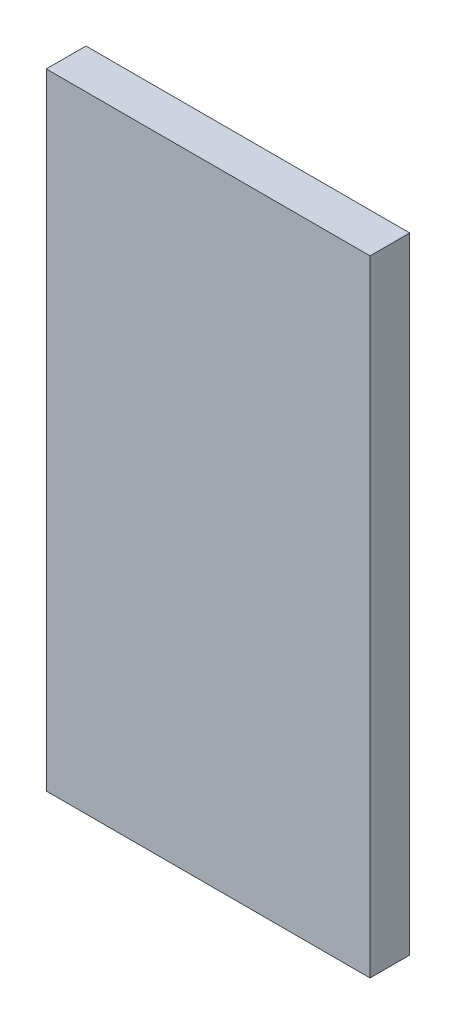
ISO-10303-21;
HEADER;
FILE_DESCRIPTION(('STEP AP214'),'2;1');
FILE_NAME('part.step','',(''),(''),'','','');
FILE_SCHEMA(('AUTOMOTIVE_DESIGN { 1 0 10303 214 1 1 1 1 }'));
ENDSEC;
DATA;
#1=APPLICATION_CONTEXT('core data for automotive mechanical design processes');
#2=APPLICATION_PROTOCOL_DEFINITION('international standard','automotive_design',2000,#1);
#3=PRODUCT_CONTEXT('',#1,'mechanical');
#4=PRODUCT('Part','Part','',(#3));
#5=PRODUCT_RELATED_PRODUCT_CATEGORY('part','',(#4));
#6=PRODUCT_DEFINITION_FORMATION('','',#4);
#7=PRODUCT_DEFINITION_CONTEXT('part definition',#1,'design');
#8=PRODUCT_DEFINITION('design','',#6,#7);
#9=PRODUCT_DEFINITION_SHAPE('','',#8);
#10=(LENGTH_UNIT() NAMED_UNIT(*) SI_UNIT(.MILLI.,.METRE.));
#11=(NAMED_UNIT(*) PLANE_ANGLE_UNIT() SI_UNIT($,.RADIAN.));
#12=(NAMED_UNIT(*) SI_UNIT($,.STERADIAN.) SOLID_ANGLE_UNIT());
#13=UNCERTAINTY_MEASURE_WITH_UNIT(LENGTH_MEASURE(1.E-05),#10,'distance_accuracy_value','');
#14=(GEOMETRIC_REPRESENTATION_CONTEXT(3) GLOBAL_UNCERTAINTY_ASSIGNED_CONTEXT((#13)) GLOBAL_UNIT_ASSIGNED_CONTEXT((#10,
#11,#12)) REPRESENTATION_CONTEXT('',''));
#15=CARTESIAN_POINT('',(0.,0.,0.));
#16=DIRECTION('',(0.,0.,1.));
#17=DIRECTION('',(1.,0.,0.));
#18=AXIS2_PLACEMENT_3D('',#15,#16,#17);
#19=CARTESIAN_POINT('',(-2.948,2.122,0.1));
#20=DIRECTION('',(0.,0.,1.));
#21=DIRECTION('',(1.,0.,0.));
#22=AXIS2_PLACEMENT_3D('',#19,#20,#21);
#23=PLANE('',#22);
#24=DIRECTION('',(0.,1.,0.));
#25=VECTOR('',#24,1.);
#26=CARTESIAN_POINT('',(-2.132,2.122,0.1));
#27=LINE('',#26,#25);
#28=CARTESIAN_POINT('',(-2.132,3.698,0.1));
#29=VERTEX_POINT('',#28);
#30=CARTESIAN_POINT('',(-2.132,2.122,0.1));
#31=VERTEX_POINT('',#30);
#32=EDGE_CURVE('E75',#29,#31,#27,.F.);
#33=ORIENTED_EDGE('',*,*,#32,.F.);
#34=DIRECTION('',(1.,0.,0.));
#35=VECTOR('',#34,1.);
#36=CARTESIAN_POINT('',(-2.948,3.698,0.1));
#37=LINE('',#36,#35);
#38=CARTESIAN_POINT('',(-2.948,3.698,0.1));
#39=VERTEX_POINT('',#38);
#40=EDGE_CURVE('E57',#39,#29,#37,.T.);
#41=ORIENTED_EDGE('',*,*,#40,.F.);
#42=DIRECTION('',(0.,1.,0.));
#43=VECTOR('',#42,1.);
#44=CARTESIAN_POINT('',(-2.948,2.122,0.1));
#45=LINE('',#44,#43);
#46=CARTESIAN_POINT('',(-2.948,2.122,0.1));
#47=VERTEX_POINT('',#46);
#48=EDGE_CURVE('E19',#39,#47,#45,.F.);
#49=ORIENTED_EDGE('',*,*,#48,.T.);
#50=DIRECTION('',(1.,0.,0.));
#51=VECTOR('',#50,1.);
#52=CARTESIAN_POINT('',(-2.948,2.122,0.1));
#53=LINE('',#52,#51);
#54=EDGE_CURVE('E54',#47,#31,#53,.T.);
#55=ORIENTED_EDGE('',*,*,#54,.T.);
#56=EDGE_LOOP('',(#33,#41,#49,#55));
#57=FACE_BOUND('',#56,.T.);
#58=ADVANCED_FACE('F16',(#57),#23,.T.);
#59=CARTESIAN_POINT('',(-2.948,2.122,0.));
#60=DIRECTION('',(1.,0.,0.));
#61=DIRECTION('',(0.,0.,-1.));
#62=AXIS2_PLACEMENT_3D('',#59,#60,#61);
#63=PLANE('',#62);
#64=DIRECTION('',(0.,0.,1.));
#65=VECTOR('',#64,1.);
#66=CARTESIAN_POINT('',(-2.948,3.698,0.));
#67=LINE('',#66,#65);
#68=CARTESIAN_POINT('',(-2.948,3.698,0.));
#69=VERTEX_POINT('',#68);
#70=EDGE_CURVE('E77',#69,#39,#67,.T.);
#71=ORIENTED_EDGE('',*,*,#70,.F.);
#72=DIRECTION('',(0.,1.,0.));
#73=VECTOR('',#72,1.);
#74=CARTESIAN_POINT('',(-2.948,2.122,0.));
#75=LINE('',#74,#73);
#76=CARTESIAN_POINT('',(-2.948,2.122,0.));
#77=VERTEX_POINT('',#76);
#78=EDGE_CURVE('E72',#69,#77,#75,.F.);
#79=ORIENTED_EDGE('',*,*,#78,.T.);
#80=DIRECTION('',(0.,0.,1.));
#81=VECTOR('',#80,1.);
#82=CARTESIAN_POINT('',(-2.948,2.122,0.));
#83=LINE('',#82,#81);
#84=EDGE_CURVE('E62',#77,#47,#83,.T.);
#85=ORIENTED_EDGE('',*,*,#84,.T.);
#86=ORIENTED_EDGE('',*,*,#48,.F.);
#87=EDGE_LOOP('',(#71,#79,#85,#86));
#88=FACE_BOUND('',#87,.T.);
#89=ADVANCED_FACE('F71',(#88),#63,.F.);
#90=CARTESIAN_POINT('',(-2.948,2.122,0.));
#91=DIRECTION('',(0.,1.,0.));
#92=DIRECTION('',(0.,0.,1.));
#93=AXIS2_PLACEMENT_3D('',#90,#91,#92);
#94=PLANE('',#93);
#95=ORIENTED_EDGE('',*,*,#54,.F.);
#96=ORIENTED_EDGE('',*,*,#84,.F.);
#97=DIRECTION('',(1.,0.,0.));
#98=VECTOR('',#97,1.);
#99=CARTESIAN_POINT('',(-2.948,2.122,0.));
#100=LINE('',#99,#98);
#101=CARTESIAN_POINT('',(-2.132,2.122,0.));
#102=VERTEX_POINT('',#101);
#103=EDGE_CURVE('E82',#77,#102,#100,.T.);
#104=ORIENTED_EDGE('',*,*,#103,.T.);
#105=DIRECTION('',(0.,0.,-1.));
#106=VECTOR('',#105,1.);
#107=CARTESIAN_POINT('',(-2.132,2.122,0.));
#108=LINE('',#107,#106);
#109=EDGE_CURVE('E68',#31,#102,#108,.T.);
#110=ORIENTED_EDGE('',*,*,#109,.F.);
#111=EDGE_LOOP('',(#95,#96,#104,#110));
#112=FACE_BOUND('',#111,.T.);
#113=ADVANCED_FACE('F65',(#112),#94,.F.);
#114=CARTESIAN_POINT('',(-2.132,2.122,0.));
#115=DIRECTION('',(1.,0.,0.));
#116=DIRECTION('',(0.,0.,-1.));
#117=AXIS2_PLACEMENT_3D('',#114,#115,#116);
#118=PLANE('',#117);
#119=DIRECTION('',(0.,0.,1.));
#120=VECTOR('',#119,1.);
#121=CARTESIAN_POINT('',(-2.132,3.698,0.));
#122=LINE('',#121,#120);
#123=CARTESIAN_POINT('',(-2.132,3.698,0.));
#124=VERTEX_POINT('',#123);
#125=EDGE_CURVE('E33',#29,#124,#122,.F.);
#126=ORIENTED_EDGE('',*,*,#125,.F.);
#127=ORIENTED_EDGE('',*,*,#32,.T.);
#128=ORIENTED_EDGE('',*,*,#109,.T.);
#129=DIRECTION('',(0.,1.,0.));
#130=VECTOR('',#129,1.);
#131=CARTESIAN_POINT('',(-2.132,2.122,0.));
#132=LINE('',#131,#130);
#133=EDGE_CURVE('E25',#102,#124,#132,.T.);
#134=ORIENTED_EDGE('',*,*,#133,.T.);
#135=EDGE_LOOP('',(#126,#127,#128,#134));
#136=FACE_BOUND('',#135,.T.);
#137=ADVANCED_FACE('F87',(#136),#118,.T.);
#138=CARTESIAN_POINT('',(-2.948,3.698,0.));
#139=DIRECTION('',(0.,1.,0.));
#140=DIRECTION('',(0.,0.,1.));
#141=AXIS2_PLACEMENT_3D('',#138,#139,#140);
#142=PLANE('',#141);
#143=ORIENTED_EDGE('',*,*,#40,.T.);
#144=ORIENTED_EDGE('',*,*,#125,.T.);
#145=DIRECTION('',(1.,0.,0.));
#146=VECTOR('',#145,1.);
#147=CARTESIAN_POINT('',(-2.948,3.698,0.));
#148=LINE('',#147,#146);
#149=EDGE_CURVE('E11',#124,#69,#148,.F.);
#150=ORIENTED_EDGE('',*,*,#149,.T.);
#151=ORIENTED_EDGE('',*,*,#70,.T.);
#152=EDGE_LOOP('',(#143,#144,#150,#151));
#153=FACE_BOUND('',#152,.T.);
#154=ADVANCED_FACE('F90',(#153),#142,.T.);
#155=CARTESIAN_POINT('',(-2.948,2.122,0.));
#156=DIRECTION('',(0.,0.,1.));
#157=DIRECTION('',(1.,0.,0.));
#158=AXIS2_PLACEMENT_3D('',#155,#156,#157);
#159=PLANE('',#158);
#160=ORIENTED_EDGE('',*,*,#133,.F.);
#161=ORIENTED_EDGE('',*,*,#103,.F.);
#162=ORIENTED_EDGE('',*,*,#78,.F.);
#163=ORIENTED_EDGE('',*,*,#149,.F.);
#164=EDGE_LOOP('',(#160,#161,#162,#163));
#165=FACE_BOUND('',#164,.T.);
#166=ADVANCED_FACE('F89',(#165),#159,.F.);
#167=CLOSED_SHELL('',(#58,#89,#113,#137,#154,#166));
#168=MANIFOLD_SOLID_BREP('B1',#167);
#169=ADVANCED_BREP_SHAPE_REPRESENTATION('',(#18,#168),#14);
#170=SHAPE_DEFINITION_REPRESENTATION(#9,#169);
ENDSEC;
END-ISO-10303-21;
